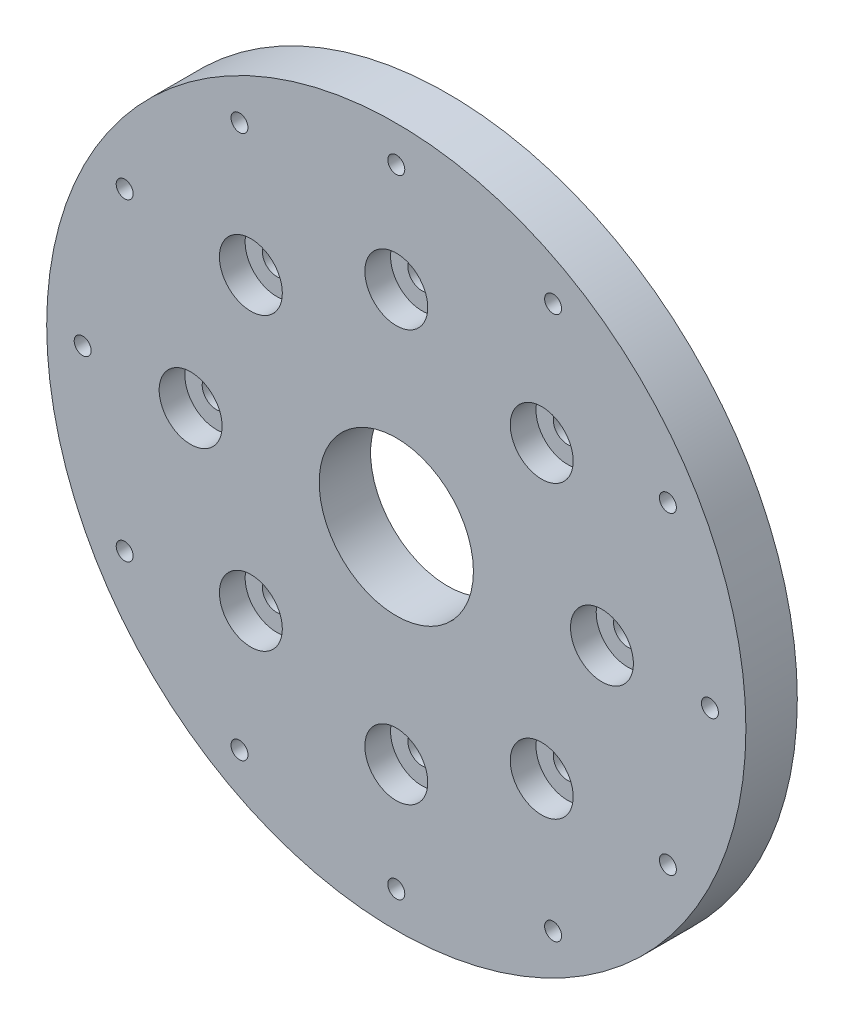
ISO-10303-21;
HEADER;
FILE_DESCRIPTION(('STEP AP214'),'2;1');
FILE_NAME('part.step','',(''),(''),'','','');
FILE_SCHEMA(('AUTOMOTIVE_DESIGN { 1 0 10303 214 1 1 1 1 }'));
ENDSEC;
DATA;
#1=APPLICATION_CONTEXT('core data for automotive mechanical design processes');
#2=APPLICATION_PROTOCOL_DEFINITION('international standard','automotive_design',2000,#1);
#3=PRODUCT_CONTEXT('',#1,'mechanical');
#4=PRODUCT('Part','Part','',(#3));
#5=PRODUCT_RELATED_PRODUCT_CATEGORY('part','',(#4));
#6=PRODUCT_DEFINITION_FORMATION('','',#4);
#7=PRODUCT_DEFINITION_CONTEXT('part definition',#1,'design');
#8=PRODUCT_DEFINITION('design','',#6,#7);
#9=PRODUCT_DEFINITION_SHAPE('','',#8);
#10=(LENGTH_UNIT() NAMED_UNIT(*) SI_UNIT(.MILLI.,.METRE.));
#11=(NAMED_UNIT(*) PLANE_ANGLE_UNIT() SI_UNIT($,.RADIAN.));
#12=(NAMED_UNIT(*) SI_UNIT($,.STERADIAN.) SOLID_ANGLE_UNIT());
#13=UNCERTAINTY_MEASURE_WITH_UNIT(LENGTH_MEASURE(1.E-05),#10,'distance_accuracy_value','');
#14=(GEOMETRIC_REPRESENTATION_CONTEXT(3) GLOBAL_UNCERTAINTY_ASSIGNED_CONTEXT((#13)) GLOBAL_UNIT_ASSIGNED_CONTEXT((#10,
#11,#12)) REPRESENTATION_CONTEXT('',''));
#15=CARTESIAN_POINT('',(0.,0.,0.));
#16=DIRECTION('',(0.,0.,1.));
#17=DIRECTION('',(1.,0.,0.));
#18=AXIS2_PLACEMENT_3D('',#15,#16,#17);
#19=CARTESIAN_POINT('',(0.,40.,10.));
#20=DIRECTION('',(0.,0.,1.));
#21=DIRECTION('',(1.,0.,0.));
#22=AXIS2_PLACEMENT_3D('',#19,#20,#21);
#23=CYLINDRICAL_SURFACE('',#22,2.75);
#24=CARTESIAN_POINT('',(0.,40.,0.));
#25=DIRECTION('',(0.,0.,1.));
#26=DIRECTION('',(1.,0.,0.));
#27=AXIS2_PLACEMENT_3D('',#24,#25,#26);
#28=CIRCLE('',#27,2.75);
#29=CARTESIAN_POINT('',(2.75,40.,0.));
#30=VERTEX_POINT('',#29);
#31=EDGE_CURVE('E126',#30,#30,#28,.T.);
#32=ORIENTED_EDGE('',*,*,#31,.F.);
#33=EDGE_LOOP('',(#32));
#34=FACE_BOUND('',#33,.T.);
#35=CARTESIAN_POINT('',(0.,40.,5.));
#36=DIRECTION('',(0.,0.,1.));
#37=DIRECTION('',(1.,0.,0.));
#38=AXIS2_PLACEMENT_3D('',#35,#36,#37);
#39=CIRCLE('',#38,2.75);
#40=CARTESIAN_POINT('',(2.75,40.,5.));
#41=VERTEX_POINT('',#40);
#42=EDGE_CURVE('E40',#41,#41,#39,.F.);
#43=ORIENTED_EDGE('',*,*,#42,.F.);
#44=EDGE_LOOP('',(#43));
#45=FACE_BOUND('',#44,.T.);
#46=ADVANCED_FACE('F36',(#34,#45),#23,.F.);
#47=CARTESIAN_POINT('',(-28.2842712474619,28.2842712474619,10.));
#48=DIRECTION('',(0.,0.,1.));
#49=DIRECTION('',(1.,0.,0.));
#50=AXIS2_PLACEMENT_3D('',#47,#48,#49);
#51=CYLINDRICAL_SURFACE('',#50,2.75);
#52=CARTESIAN_POINT('',(-28.2842712474619,28.2842712474619,0.));
#53=DIRECTION('',(0.,0.,1.));
#54=DIRECTION('',(1.,0.,0.));
#55=AXIS2_PLACEMENT_3D('',#52,#53,#54);
#56=CIRCLE('',#55,2.75);
#57=CARTESIAN_POINT('',(-25.5342712474619,28.2842712474619,0.));
#58=VERTEX_POINT('',#57);
#59=EDGE_CURVE('E120',#58,#58,#56,.T.);
#60=ORIENTED_EDGE('',*,*,#59,.F.);
#61=EDGE_LOOP('',(#60));
#62=FACE_BOUND('',#61,.T.);
#63=CARTESIAN_POINT('',(-28.2842712474619,28.2842712474619,5.));
#64=DIRECTION('',(0.,0.,1.));
#65=DIRECTION('',(1.,0.,0.));
#66=AXIS2_PLACEMENT_3D('',#63,#64,#65);
#67=CIRCLE('',#66,2.75);
#68=CARTESIAN_POINT('',(-25.5342712474619,28.2842712474619,5.));
#69=VERTEX_POINT('',#68);
#70=EDGE_CURVE('E75',#69,#69,#67,.F.);
#71=ORIENTED_EDGE('',*,*,#70,.F.);
#72=EDGE_LOOP('',(#71));
#73=FACE_BOUND('',#72,.T.);
#74=ADVANCED_FACE('F172',(#62,#73),#51,.F.);
#75=CARTESIAN_POINT('',(-40.,-1.38777878078145E-13,10.));
#76=DIRECTION('',(0.,0.,1.));
#77=DIRECTION('',(1.,0.,0.));
#78=AXIS2_PLACEMENT_3D('',#75,#76,#77);
#79=CYLINDRICAL_SURFACE('',#78,2.75);
#80=CARTESIAN_POINT('',(-40.,-1.38777878078145E-13,0.));
#81=DIRECTION('',(0.,0.,1.));
#82=DIRECTION('',(1.,0.,0.));
#83=AXIS2_PLACEMENT_3D('',#80,#81,#82);
#84=CIRCLE('',#83,2.75);
#85=CARTESIAN_POINT('',(-37.25,-1.38777878078145E-13,0.));
#86=VERTEX_POINT('',#85);
#87=EDGE_CURVE('E114',#86,#86,#84,.T.);
#88=ORIENTED_EDGE('',*,*,#87,.F.);
#89=EDGE_LOOP('',(#88));
#90=FACE_BOUND('',#89,.T.);
#91=CARTESIAN_POINT('',(-40.,-1.38777878078145E-13,5.));
#92=DIRECTION('',(0.,0.,1.));
#93=DIRECTION('',(1.,0.,0.));
#94=AXIS2_PLACEMENT_3D('',#91,#92,#93);
#95=CIRCLE('',#94,2.75);
#96=CARTESIAN_POINT('',(-37.25,-1.38777878078145E-13,5.));
#97=VERTEX_POINT('',#96);
#98=EDGE_CURVE('E73',#97,#97,#95,.F.);
#99=ORIENTED_EDGE('',*,*,#98,.F.);
#100=EDGE_LOOP('',(#99));
#101=FACE_BOUND('',#100,.T.);
#102=ADVANCED_FACE('F178',(#90,#101),#79,.F.);
#103=CARTESIAN_POINT('',(-28.284271247462,-28.2842712474618,10.));
#104=DIRECTION('',(0.,0.,1.));
#105=DIRECTION('',(1.,0.,0.));
#106=AXIS2_PLACEMENT_3D('',#103,#104,#105);
#107=CYLINDRICAL_SURFACE('',#106,2.75);
#108=CARTESIAN_POINT('',(-28.284271247462,-28.2842712474618,0.));
#109=DIRECTION('',(0.,0.,1.));
#110=DIRECTION('',(1.,0.,0.));
#111=AXIS2_PLACEMENT_3D('',#108,#109,#110);
#112=CIRCLE('',#111,2.75);
#113=CARTESIAN_POINT('',(-25.534271247462,-28.2842712474618,0.));
#114=VERTEX_POINT('',#113);
#115=EDGE_CURVE('E108',#114,#114,#112,.T.);
#116=ORIENTED_EDGE('',*,*,#115,.F.);
#117=EDGE_LOOP('',(#116));
#118=FACE_BOUND('',#117,.T.);
#119=CARTESIAN_POINT('',(-28.284271247462,-28.2842712474618,5.));
#120=DIRECTION('',(0.,0.,1.));
#121=DIRECTION('',(1.,0.,0.));
#122=AXIS2_PLACEMENT_3D('',#119,#120,#121);
#123=CIRCLE('',#122,2.75);
#124=CARTESIAN_POINT('',(-25.534271247462,-28.2842712474618,5.));
#125=VERTEX_POINT('',#124);
#126=EDGE_CURVE('E70',#125,#125,#123,.F.);
#127=ORIENTED_EDGE('',*,*,#126,.F.);
#128=EDGE_LOOP('',(#127));
#129=FACE_BOUND('',#128,.T.);
#130=ADVANCED_FACE('F243',(#118,#129),#107,.F.);
#131=CARTESIAN_POINT('',(2.77555756156289E-13,-40.,10.));
#132=DIRECTION('',(0.,0.,1.));
#133=DIRECTION('',(1.,0.,0.));
#134=AXIS2_PLACEMENT_3D('',#131,#132,#133);
#135=CYLINDRICAL_SURFACE('',#134,2.75);
#136=CARTESIAN_POINT('',(2.77555756156289E-13,-40.,0.));
#137=DIRECTION('',(0.,0.,1.));
#138=DIRECTION('',(1.,0.,0.));
#139=AXIS2_PLACEMENT_3D('',#136,#137,#138);
#140=CIRCLE('',#139,2.75);
#141=CARTESIAN_POINT('',(2.75000000000028,-40.,0.));
#142=VERTEX_POINT('',#141);
#143=EDGE_CURVE('E102',#142,#142,#140,.T.);
#144=ORIENTED_EDGE('',*,*,#143,.F.);
#145=EDGE_LOOP('',(#144));
#146=FACE_BOUND('',#145,.T.);
#147=CARTESIAN_POINT('',(2.77555756156289E-13,-40.,5.));
#148=DIRECTION('',(0.,0.,1.));
#149=DIRECTION('',(1.,0.,0.));
#150=AXIS2_PLACEMENT_3D('',#147,#148,#149);
#151=CIRCLE('',#150,2.75);
#152=CARTESIAN_POINT('',(2.75000000000028,-40.,5.));
#153=VERTEX_POINT('',#152);
#154=EDGE_CURVE('E67',#153,#153,#151,.F.);
#155=ORIENTED_EDGE('',*,*,#154,.F.);
#156=EDGE_LOOP('',(#155));
#157=FACE_BOUND('',#156,.T.);
#158=ADVANCED_FACE('F291',(#146,#157),#135,.F.);
#159=CARTESIAN_POINT('',(28.2842712474621,-28.2842712474617,10.));
#160=DIRECTION('',(0.,0.,1.));
#161=DIRECTION('',(1.,0.,0.));
#162=AXIS2_PLACEMENT_3D('',#159,#160,#161);
#163=CYLINDRICAL_SURFACE('',#162,2.75);
#164=CARTESIAN_POINT('',(28.2842712474621,-28.2842712474617,0.));
#165=DIRECTION('',(0.,0.,1.));
#166=DIRECTION('',(1.,0.,0.));
#167=AXIS2_PLACEMENT_3D('',#164,#165,#166);
#168=CIRCLE('',#167,2.75);
#169=CARTESIAN_POINT('',(31.0342712474621,-28.2842712474617,0.));
#170=VERTEX_POINT('',#169);
#171=EDGE_CURVE('E96',#170,#170,#168,.T.);
#172=ORIENTED_EDGE('',*,*,#171,.F.);
#173=EDGE_LOOP('',(#172));
#174=FACE_BOUND('',#173,.T.);
#175=CARTESIAN_POINT('',(28.2842712474621,-28.2842712474617,5.));
#176=DIRECTION('',(0.,0.,1.));
#177=DIRECTION('',(1.,0.,0.));
#178=AXIS2_PLACEMENT_3D('',#175,#176,#177);
#179=CIRCLE('',#178,2.75);
#180=CARTESIAN_POINT('',(31.0342712474621,-28.2842712474617,5.));
#181=VERTEX_POINT('',#180);
#182=EDGE_CURVE('E63',#181,#181,#179,.F.);
#183=ORIENTED_EDGE('',*,*,#182,.F.);
#184=EDGE_LOOP('',(#183));
#185=FACE_BOUND('',#184,.T.);
#186=ADVANCED_FACE('F207',(#174,#185),#163,.F.);
#187=CARTESIAN_POINT('',(40.,4.1286418728248E-13,10.));
#188=DIRECTION('',(0.,0.,1.));
#189=DIRECTION('',(1.,0.,0.));
#190=AXIS2_PLACEMENT_3D('',#187,#188,#189);
#191=CYLINDRICAL_SURFACE('',#190,2.75);
#192=CARTESIAN_POINT('',(40.,4.1286418728248E-13,0.));
#193=DIRECTION('',(0.,0.,1.));
#194=DIRECTION('',(1.,0.,0.));
#195=AXIS2_PLACEMENT_3D('',#192,#193,#194);
#196=CIRCLE('',#195,2.75);
#197=CARTESIAN_POINT('',(42.75,4.1286418728248E-13,0.));
#198=VERTEX_POINT('',#197);
#199=EDGE_CURVE('E84',#198,#198,#196,.T.);
#200=ORIENTED_EDGE('',*,*,#199,.F.);
#201=EDGE_LOOP('',(#200));
#202=FACE_BOUND('',#201,.T.);
#203=CARTESIAN_POINT('',(40.,4.1286418728248E-13,5.));
#204=DIRECTION('',(0.,0.,1.));
#205=DIRECTION('',(1.,0.,0.));
#206=AXIS2_PLACEMENT_3D('',#203,#204,#205);
#207=CIRCLE('',#206,2.75);
#208=CARTESIAN_POINT('',(42.75,4.1286418728248E-13,5.));
#209=VERTEX_POINT('',#208);
#210=EDGE_CURVE('E60',#209,#209,#207,.F.);
#211=ORIENTED_EDGE('',*,*,#210,.F.);
#212=EDGE_LOOP('',(#211));
#213=FACE_BOUND('',#212,.T.);
#214=ADVANCED_FACE('F200',(#202,#213),#191,.F.);
#215=CARTESIAN_POINT('',(28.284271247462,28.2842712474618,10.));
#216=DIRECTION('',(0.,0.,1.));
#217=DIRECTION('',(1.,0.,0.));
#218=AXIS2_PLACEMENT_3D('',#215,#216,#217);
#219=CYLINDRICAL_SURFACE('',#218,2.75);
#220=CARTESIAN_POINT('',(28.284271247462,28.2842712474618,0.));
#221=DIRECTION('',(0.,0.,1.));
#222=DIRECTION('',(1.,0.,0.));
#223=AXIS2_PLACEMENT_3D('',#220,#221,#222);
#224=CIRCLE('',#223,2.75);
#225=CARTESIAN_POINT('',(31.034271247462,28.2842712474618,0.));
#226=VERTEX_POINT('',#225);
#227=EDGE_CURVE('E139',#226,#226,#224,.T.);
#228=ORIENTED_EDGE('',*,*,#227,.F.);
#229=EDGE_LOOP('',(#228));
#230=FACE_BOUND('',#229,.T.);
#231=CARTESIAN_POINT('',(28.284271247462,28.2842712474618,5.));
#232=DIRECTION('',(0.,0.,1.));
#233=DIRECTION('',(1.,0.,0.));
#234=AXIS2_PLACEMENT_3D('',#231,#232,#233);
#235=CIRCLE('',#234,2.75);
#236=CARTESIAN_POINT('',(31.034271247462,28.2842712474618,5.));
#237=VERTEX_POINT('',#236);
#238=EDGE_CURVE('E55',#237,#237,#235,.F.);
#239=ORIENTED_EDGE('',*,*,#238,.F.);
#240=EDGE_LOOP('',(#239));
#241=FACE_BOUND('',#240,.T.);
#242=ADVANCED_FACE('F197',(#230,#241),#219,.F.);
#243=CARTESIAN_POINT('',(0.,0.,10.));
#244=DIRECTION('',(0.,0.,1.));
#245=DIRECTION('',(1.,0.,0.));
#246=AXIS2_PLACEMENT_3D('',#243,#244,#245);
#247=PLANE('',#246);
#248=CARTESIAN_POINT('',(30.4999999999993,52.8275496308511,10.));
#249=DIRECTION('',(0.,0.,1.));
#250=DIRECTION('',(1.,0.,0.));
#251=AXIS2_PLACEMENT_3D('',#248,#249,#250);
#252=CIRCLE('',#251,1.65);
#253=CARTESIAN_POINT('',(32.1499999999993,52.8275496308511,10.));
#254=VERTEX_POINT('',#253);
#255=EDGE_CURVE('E412',#254,#254,#252,.T.);
#256=ORIENTED_EDGE('',*,*,#255,.F.);
#257=EDGE_LOOP('',(#256));
#258=FACE_BOUND('',#257,.T.);
#259=CARTESIAN_POINT('',(52.8275496308503,30.5000000000006,10.));
#260=DIRECTION('',(0.,0.,1.));
#261=DIRECTION('',(1.,0.,0.));
#262=AXIS2_PLACEMENT_3D('',#259,#260,#261);
#263=CIRCLE('',#262,1.65);
#264=CARTESIAN_POINT('',(54.4775496308503,30.5000000000006,10.));
#265=VERTEX_POINT('',#264);
#266=EDGE_CURVE('E406',#265,#265,#263,.T.);
#267=ORIENTED_EDGE('',*,*,#266,.F.);
#268=EDGE_LOOP('',(#267));
#269=FACE_BOUND('',#268,.T.);
#270=CARTESIAN_POINT('',(60.9999999999999,6.38941085008293E-13,10.));
#271=DIRECTION('',(0.,0.,1.));
#272=DIRECTION('',(1.,0.,0.));
#273=AXIS2_PLACEMENT_3D('',#270,#271,#272);
#274=CIRCLE('',#273,1.65);
#275=CARTESIAN_POINT('',(62.6499999999999,6.38941085008293E-13,10.));
#276=VERTEX_POINT('',#275);
#277=EDGE_CURVE('E400',#276,#276,#274,.T.);
#278=ORIENTED_EDGE('',*,*,#277,.F.);
#279=EDGE_LOOP('',(#278));
#280=FACE_BOUND('',#279,.T.);
#281=CARTESIAN_POINT('',(52.827549630851,-30.4999999999995,10.));
#282=DIRECTION('',(0.,0.,1.));
#283=DIRECTION('',(1.,0.,0.));
#284=AXIS2_PLACEMENT_3D('',#281,#282,#283);
#285=CIRCLE('',#284,1.65);
#286=CARTESIAN_POINT('',(54.477549630851,-30.4999999999995,10.));
#287=VERTEX_POINT('',#286);
#288=EDGE_CURVE('E394',#287,#287,#285,.T.);
#289=ORIENTED_EDGE('',*,*,#288,.F.);
#290=EDGE_LOOP('',(#289));
#291=FACE_BOUND('',#290,.T.);
#292=CARTESIAN_POINT('',(30.5000000000004,-52.8275496308505,10.));
#293=DIRECTION('',(0.,0.,1.));
#294=DIRECTION('',(1.,0.,0.));
#295=AXIS2_PLACEMENT_3D('',#292,#293,#294);
#296=CIRCLE('',#295,1.65);
#297=CARTESIAN_POINT('',(32.1500000000004,-52.8275496308505,10.));
#298=VERTEX_POINT('',#297);
#299=EDGE_CURVE('E388',#298,#298,#296,.T.);
#300=ORIENTED_EDGE('',*,*,#299,.F.);
#301=EDGE_LOOP('',(#300));
#302=FACE_BOUND('',#301,.T.);
#303=CARTESIAN_POINT('',(0.,-60.9999999999999,10.));
#304=DIRECTION('',(0.,0.,1.));
#305=DIRECTION('',(1.,0.,0.));
#306=AXIS2_PLACEMENT_3D('',#303,#304,#305);
#307=CIRCLE('',#306,1.65);
#308=CARTESIAN_POINT('',(1.65,-60.9999999999999,10.));
#309=VERTEX_POINT('',#308);
#310=EDGE_CURVE('E382',#309,#309,#307,.T.);
#311=ORIENTED_EDGE('',*,*,#310,.F.);
#312=EDGE_LOOP('',(#311));
#313=FACE_BOUND('',#312,.T.);
#314=CARTESIAN_POINT('',(-30.4999999999997,-52.8275496308509,10.));
#315=DIRECTION('',(0.,0.,1.));
#316=DIRECTION('',(1.,0.,0.));
#317=AXIS2_PLACEMENT_3D('',#314,#315,#316);
#318=CIRCLE('',#317,1.65);
#319=CARTESIAN_POINT('',(-28.8499999999997,-52.8275496308509,10.));
#320=VERTEX_POINT('',#319);
#321=EDGE_CURVE('E376',#320,#320,#318,.T.);
#322=ORIENTED_EDGE('',*,*,#321,.F.);
#323=EDGE_LOOP('',(#322));
#324=FACE_BOUND('',#323,.T.);
#325=CARTESIAN_POINT('',(-52.8275496308506,-30.5000000000002,10.));
#326=DIRECTION('',(0.,0.,1.));
#327=DIRECTION('',(1.,0.,0.));
#328=AXIS2_PLACEMENT_3D('',#325,#326,#327);
#329=CIRCLE('',#328,1.65);
#330=CARTESIAN_POINT('',(-51.1775496308506,-30.5000000000002,10.));
#331=VERTEX_POINT('',#330);
#332=EDGE_CURVE('E370',#331,#331,#329,.T.);
#333=ORIENTED_EDGE('',*,*,#332,.F.);
#334=EDGE_LOOP('',(#333));
#335=FACE_BOUND('',#334,.T.);
#336=CARTESIAN_POINT('',(-60.9999999999999,-2.12980361669431E-13,10.));
#337=DIRECTION('',(0.,0.,1.));
#338=DIRECTION('',(1.,0.,0.));
#339=AXIS2_PLACEMENT_3D('',#336,#337,#338);
#340=CIRCLE('',#339,1.65);
#341=CARTESIAN_POINT('',(-59.3499999999999,-2.12980361669431E-13,10.));
#342=VERTEX_POINT('',#341);
#343=EDGE_CURVE('E364',#342,#342,#340,.T.);
#344=ORIENTED_EDGE('',*,*,#343,.F.);
#345=EDGE_LOOP('',(#344));
#346=FACE_BOUND('',#345,.T.);
#347=CARTESIAN_POINT('',(-52.8275496308508,30.4999999999999,10.));
#348=DIRECTION('',(0.,0.,1.));
#349=DIRECTION('',(1.,0.,0.));
#350=AXIS2_PLACEMENT_3D('',#347,#348,#349);
#351=CIRCLE('',#350,1.65);
#352=CARTESIAN_POINT('',(-51.1775496308508,30.4999999999999,10.));
#353=VERTEX_POINT('',#352);
#354=EDGE_CURVE('E358',#353,#353,#351,.T.);
#355=ORIENTED_EDGE('',*,*,#354,.F.);
#356=EDGE_LOOP('',(#355));
#357=FACE_BOUND('',#356,.T.);
#358=CARTESIAN_POINT('',(-30.5,52.8275496308507,10.));
#359=DIRECTION('',(0.,0.,1.));
#360=DIRECTION('',(1.,0.,0.));
#361=AXIS2_PLACEMENT_3D('',#358,#359,#360);
#362=CIRCLE('',#361,1.65);
#363=CARTESIAN_POINT('',(-28.85,52.8275496308507,10.));
#364=VERTEX_POINT('',#363);
#365=EDGE_CURVE('E350',#364,#364,#362,.T.);
#366=ORIENTED_EDGE('',*,*,#365,.F.);
#367=EDGE_LOOP('',(#366));
#368=FACE_BOUND('',#367,.T.);
#369=CARTESIAN_POINT('',(0.,60.9999999999999,10.));
#370=DIRECTION('',(0.,0.,1.));
#371=DIRECTION('',(1.,0.,0.));
#372=AXIS2_PLACEMENT_3D('',#369,#370,#371);
#373=CIRCLE('',#372,1.65);
#374=CARTESIAN_POINT('',(1.65,60.9999999999999,10.));
#375=VERTEX_POINT('',#374);
#376=EDGE_CURVE('E342',#375,#375,#373,.T.);
#377=ORIENTED_EDGE('',*,*,#376,.F.);
#378=EDGE_LOOP('',(#377));
#379=FACE_BOUND('',#378,.T.);
#380=CARTESIAN_POINT('',(40.,4.1286418728248E-13,10.));
#381=DIRECTION('',(0.,0.,1.));
#382=DIRECTION('',(1.,0.,0.));
#383=AXIS2_PLACEMENT_3D('',#380,#381,#382);
#384=CIRCLE('',#383,6.11899999999999);
#385=CARTESIAN_POINT('',(46.119,4.1286418728248E-13,10.));
#386=VERTEX_POINT('',#385);
#387=EDGE_CURVE('E80',#386,#386,#384,.T.);
#388=ORIENTED_EDGE('',*,*,#387,.F.);
#389=EDGE_LOOP('',(#388));
#390=FACE_BOUND('',#389,.T.);
#391=CARTESIAN_POINT('',(28.2842712474621,-28.2842712474617,10.));
#392=DIRECTION('',(0.,0.,1.));
#393=DIRECTION('',(1.,0.,0.));
#394=AXIS2_PLACEMENT_3D('',#391,#392,#393);
#395=CIRCLE('',#394,6.119);
#396=CARTESIAN_POINT('',(34.4032712474621,-28.2842712474617,10.));
#397=VERTEX_POINT('',#396);
#398=EDGE_CURVE('E89',#397,#397,#395,.T.);
#399=ORIENTED_EDGE('',*,*,#398,.F.);
#400=EDGE_LOOP('',(#399));
#401=FACE_BOUND('',#400,.T.);
#402=CARTESIAN_POINT('',(2.77555756156289E-13,-40.,10.));
#403=DIRECTION('',(0.,0.,1.));
#404=DIRECTION('',(1.,0.,0.));
#405=AXIS2_PLACEMENT_3D('',#402,#403,#404);
#406=CIRCLE('',#405,6.119);
#407=CARTESIAN_POINT('',(6.11900000000027,-40.,10.));
#408=VERTEX_POINT('',#407);
#409=EDGE_CURVE('E99',#408,#408,#406,.T.);
#410=ORIENTED_EDGE('',*,*,#409,.F.);
#411=EDGE_LOOP('',(#410));
#412=FACE_BOUND('',#411,.T.);
#413=CARTESIAN_POINT('',(-28.284271247462,-28.2842712474618,10.));
#414=DIRECTION('',(0.,0.,1.));
#415=DIRECTION('',(1.,0.,0.));
#416=AXIS2_PLACEMENT_3D('',#413,#414,#415);
#417=CIRCLE('',#416,6.119);
#418=CARTESIAN_POINT('',(-22.165271247462,-28.2842712474618,10.));
#419=VERTEX_POINT('',#418);
#420=EDGE_CURVE('E105',#419,#419,#417,.T.);
#421=ORIENTED_EDGE('',*,*,#420,.F.);
#422=EDGE_LOOP('',(#421));
#423=FACE_BOUND('',#422,.T.);
#424=CARTESIAN_POINT('',(-40.,-1.38777878078145E-13,10.));
#425=DIRECTION('',(0.,0.,1.));
#426=DIRECTION('',(1.,0.,0.));
#427=AXIS2_PLACEMENT_3D('',#424,#425,#426);
#428=CIRCLE('',#427,6.11899999999999);
#429=CARTESIAN_POINT('',(-33.881,-1.38777878078145E-13,10.));
#430=VERTEX_POINT('',#429);
#431=EDGE_CURVE('E111',#430,#430,#428,.T.);
#432=ORIENTED_EDGE('',*,*,#431,.F.);
#433=EDGE_LOOP('',(#432));
#434=FACE_BOUND('',#433,.T.);
#435=CARTESIAN_POINT('',(-28.2842712474619,28.2842712474619,10.));
#436=DIRECTION('',(0.,0.,1.));
#437=DIRECTION('',(1.,0.,0.));
#438=AXIS2_PLACEMENT_3D('',#435,#436,#437);
#439=CIRCLE('',#438,6.119);
#440=CARTESIAN_POINT('',(-22.165271247462,28.2842712474619,10.));
#441=VERTEX_POINT('',#440);
#442=EDGE_CURVE('E117',#441,#441,#439,.T.);
#443=ORIENTED_EDGE('',*,*,#442,.F.);
#444=EDGE_LOOP('',(#443));
#445=FACE_BOUND('',#444,.T.);
#446=CARTESIAN_POINT('',(0.,40.,10.));
#447=DIRECTION('',(0.,0.,1.));
#448=DIRECTION('',(1.,0.,0.));
#449=AXIS2_PLACEMENT_3D('',#446,#447,#448);
#450=CIRCLE('',#449,6.119);
#451=CARTESIAN_POINT('',(6.119,40.,10.));
#452=VERTEX_POINT('',#451);
#453=EDGE_CURVE('E123',#452,#452,#450,.T.);
#454=ORIENTED_EDGE('',*,*,#453,.F.);
#455=EDGE_LOOP('',(#454));
#456=FACE_BOUND('',#455,.T.);
#457=CARTESIAN_POINT('',(0.,0.,10.));
#458=DIRECTION('',(0.,0.,1.));
#459=DIRECTION('',(1.,0.,0.));
#460=AXIS2_PLACEMENT_3D('',#457,#458,#459);
#461=CIRCLE('',#460,15.);
#462=CARTESIAN_POINT('',(15.,0.,10.));
#463=VERTEX_POINT('',#462);
#464=EDGE_CURVE('E44',#463,#463,#461,.T.);
#465=ORIENTED_EDGE('',*,*,#464,.F.);
#466=EDGE_LOOP('',(#465));
#467=FACE_BOUND('',#466,.T.);
#468=CARTESIAN_POINT('',(28.284271247462,28.2842712474618,10.));
#469=DIRECTION('',(0.,0.,1.));
#470=DIRECTION('',(1.,0.,0.));
#471=AXIS2_PLACEMENT_3D('',#468,#469,#470);
#472=CIRCLE('',#471,6.119);
#473=CARTESIAN_POINT('',(34.403271247462,28.2842712474618,10.));
#474=VERTEX_POINT('',#473);
#475=EDGE_CURVE('E134',#474,#474,#472,.T.);
#476=ORIENTED_EDGE('',*,*,#475,.F.);
#477=EDGE_LOOP('',(#476));
#478=FACE_BOUND('',#477,.T.);
#479=CARTESIAN_POINT('',(0.,0.,10.));
#480=DIRECTION('',(0.,0.,1.));
#481=DIRECTION('',(1.,0.,0.));
#482=AXIS2_PLACEMENT_3D('',#479,#480,#481);
#483=CIRCLE('',#482,68.);
#484=CARTESIAN_POINT('',(68.,0.,10.));
#485=VERTEX_POINT('',#484);
#486=EDGE_CURVE('E58',#485,#485,#483,.T.);
#487=ORIENTED_EDGE('',*,*,#486,.T.);
#488=EDGE_LOOP('',(#487));
#489=FACE_BOUND('',#488,.T.);
#490=ADVANCED_FACE('F199',(#258,#269,#280,#291,#302,#313,#324,#335,#346,#357,#368,#379,#390,
#401,#412,#423,#434,#445,#456,#467,#478,#489),#247,.T.);
#491=CARTESIAN_POINT('',(0.,0.,0.));
#492=DIRECTION('',(0.,0.,1.));
#493=DIRECTION('',(1.,0.,0.));
#494=AXIS2_PLACEMENT_3D('',#491,#492,#493);
#495=PLANE('',#494);
#496=CARTESIAN_POINT('',(30.4999999999993,52.8275496308511,0.));
#497=DIRECTION('',(0.,0.,1.));
#498=DIRECTION('',(1.,0.,0.));
#499=AXIS2_PLACEMENT_3D('',#496,#497,#498);
#500=CIRCLE('',#499,1.65);
#501=CARTESIAN_POINT('',(32.1499999999993,52.8275496308511,0.));
#502=VERTEX_POINT('',#501);
#503=EDGE_CURVE('E409',#502,#502,#500,.T.);
#504=ORIENTED_EDGE('',*,*,#503,.T.);
#505=EDGE_LOOP('',(#504));
#506=FACE_BOUND('',#505,.T.);
#507=CARTESIAN_POINT('',(52.8275496308503,30.5000000000006,0.));
#508=DIRECTION('',(0.,0.,1.));
#509=DIRECTION('',(1.,0.,0.));
#510=AXIS2_PLACEMENT_3D('',#507,#508,#509);
#511=CIRCLE('',#510,1.65);
#512=CARTESIAN_POINT('',(54.4775496308503,30.5000000000006,0.));
#513=VERTEX_POINT('',#512);
#514=EDGE_CURVE('E403',#513,#513,#511,.T.);
#515=ORIENTED_EDGE('',*,*,#514,.T.);
#516=EDGE_LOOP('',(#515));
#517=FACE_BOUND('',#516,.T.);
#518=CARTESIAN_POINT('',(60.9999999999999,6.38941085008293E-13,0.));
#519=DIRECTION('',(0.,0.,1.));
#520=DIRECTION('',(1.,0.,0.));
#521=AXIS2_PLACEMENT_3D('',#518,#519,#520);
#522=CIRCLE('',#521,1.65);
#523=CARTESIAN_POINT('',(62.6499999999999,6.38941085008293E-13,0.));
#524=VERTEX_POINT('',#523);
#525=EDGE_CURVE('E397',#524,#524,#522,.T.);
#526=ORIENTED_EDGE('',*,*,#525,.T.);
#527=EDGE_LOOP('',(#526));
#528=FACE_BOUND('',#527,.T.);
#529=CARTESIAN_POINT('',(52.827549630851,-30.4999999999995,0.));
#530=DIRECTION('',(0.,0.,1.));
#531=DIRECTION('',(1.,0.,0.));
#532=AXIS2_PLACEMENT_3D('',#529,#530,#531);
#533=CIRCLE('',#532,1.65);
#534=CARTESIAN_POINT('',(54.477549630851,-30.4999999999995,0.));
#535=VERTEX_POINT('',#534);
#536=EDGE_CURVE('E391',#535,#535,#533,.T.);
#537=ORIENTED_EDGE('',*,*,#536,.T.);
#538=EDGE_LOOP('',(#537));
#539=FACE_BOUND('',#538,.T.);
#540=CARTESIAN_POINT('',(30.5000000000004,-52.8275496308505,0.));
#541=DIRECTION('',(0.,0.,1.));
#542=DIRECTION('',(1.,0.,0.));
#543=AXIS2_PLACEMENT_3D('',#540,#541,#542);
#544=CIRCLE('',#543,1.65);
#545=CARTESIAN_POINT('',(32.1500000000004,-52.8275496308505,0.));
#546=VERTEX_POINT('',#545);
#547=EDGE_CURVE('E385',#546,#546,#544,.T.);
#548=ORIENTED_EDGE('',*,*,#547,.T.);
#549=EDGE_LOOP('',(#548));
#550=FACE_BOUND('',#549,.T.);
#551=CARTESIAN_POINT('',(0.,-60.9999999999999,0.));
#552=DIRECTION('',(0.,0.,1.));
#553=DIRECTION('',(1.,0.,0.));
#554=AXIS2_PLACEMENT_3D('',#551,#552,#553);
#555=CIRCLE('',#554,1.65);
#556=CARTESIAN_POINT('',(1.65,-60.9999999999999,0.));
#557=VERTEX_POINT('',#556);
#558=EDGE_CURVE('E379',#557,#557,#555,.T.);
#559=ORIENTED_EDGE('',*,*,#558,.T.);
#560=EDGE_LOOP('',(#559));
#561=FACE_BOUND('',#560,.T.);
#562=CARTESIAN_POINT('',(-30.4999999999997,-52.8275496308509,0.));
#563=DIRECTION('',(0.,0.,1.));
#564=DIRECTION('',(1.,0.,0.));
#565=AXIS2_PLACEMENT_3D('',#562,#563,#564);
#566=CIRCLE('',#565,1.65);
#567=CARTESIAN_POINT('',(-28.8499999999997,-52.8275496308509,0.));
#568=VERTEX_POINT('',#567);
#569=EDGE_CURVE('E373',#568,#568,#566,.T.);
#570=ORIENTED_EDGE('',*,*,#569,.T.);
#571=EDGE_LOOP('',(#570));
#572=FACE_BOUND('',#571,.T.);
#573=CARTESIAN_POINT('',(-52.8275496308506,-30.5000000000002,0.));
#574=DIRECTION('',(0.,0.,1.));
#575=DIRECTION('',(1.,0.,0.));
#576=AXIS2_PLACEMENT_3D('',#573,#574,#575);
#577=CIRCLE('',#576,1.65);
#578=CARTESIAN_POINT('',(-51.1775496308506,-30.5000000000002,0.));
#579=VERTEX_POINT('',#578);
#580=EDGE_CURVE('E367',#579,#579,#577,.T.);
#581=ORIENTED_EDGE('',*,*,#580,.T.);
#582=EDGE_LOOP('',(#581));
#583=FACE_BOUND('',#582,.T.);
#584=CARTESIAN_POINT('',(-60.9999999999999,-2.12980361669431E-13,0.));
#585=DIRECTION('',(0.,0.,1.));
#586=DIRECTION('',(1.,0.,0.));
#587=AXIS2_PLACEMENT_3D('',#584,#585,#586);
#588=CIRCLE('',#587,1.65);
#589=CARTESIAN_POINT('',(-59.3499999999999,-2.12980361669431E-13,0.));
#590=VERTEX_POINT('',#589);
#591=EDGE_CURVE('E361',#590,#590,#588,.T.);
#592=ORIENTED_EDGE('',*,*,#591,.T.);
#593=EDGE_LOOP('',(#592));
#594=FACE_BOUND('',#593,.T.);
#595=CARTESIAN_POINT('',(-52.8275496308508,30.4999999999999,0.));
#596=DIRECTION('',(0.,0.,1.));
#597=DIRECTION('',(1.,0.,0.));
#598=AXIS2_PLACEMENT_3D('',#595,#596,#597);
#599=CIRCLE('',#598,1.65);
#600=CARTESIAN_POINT('',(-51.1775496308508,30.4999999999999,0.));
#601=VERTEX_POINT('',#600);
#602=EDGE_CURVE('E355',#601,#601,#599,.T.);
#603=ORIENTED_EDGE('',*,*,#602,.T.);
#604=EDGE_LOOP('',(#603));
#605=FACE_BOUND('',#604,.T.);
#606=CARTESIAN_POINT('',(-30.5,52.8275496308507,0.));
#607=DIRECTION('',(0.,0.,1.));
#608=DIRECTION('',(1.,0.,0.));
#609=AXIS2_PLACEMENT_3D('',#606,#607,#608);
#610=CIRCLE('',#609,1.65);
#611=CARTESIAN_POINT('',(-28.85,52.8275496308507,0.));
#612=VERTEX_POINT('',#611);
#613=EDGE_CURVE('E346',#612,#612,#610,.T.);
#614=ORIENTED_EDGE('',*,*,#613,.T.);
#615=EDGE_LOOP('',(#614));
#616=FACE_BOUND('',#615,.T.);
#617=CARTESIAN_POINT('',(0.,60.9999999999999,0.));
#618=DIRECTION('',(0.,0.,1.));
#619=DIRECTION('',(1.,0.,0.));
#620=AXIS2_PLACEMENT_3D('',#617,#618,#619);
#621=CIRCLE('',#620,1.65);
#622=CARTESIAN_POINT('',(1.65,60.9999999999999,0.));
#623=VERTEX_POINT('',#622);
#624=EDGE_CURVE('E328',#623,#623,#621,.T.);
#625=ORIENTED_EDGE('',*,*,#624,.T.);
#626=EDGE_LOOP('',(#625));
#627=FACE_BOUND('',#626,.T.);
#628=CARTESIAN_POINT('',(0.,0.,0.));
#629=DIRECTION('',(0.,0.,1.));
#630=DIRECTION('',(1.,0.,0.));
#631=AXIS2_PLACEMENT_3D('',#628,#629,#630);
#632=CIRCLE('',#631,55.);
#633=CARTESIAN_POINT('',(55.,0.,0.));
#634=VERTEX_POINT('',#633);
#635=EDGE_CURVE('E52',#634,#634,#632,.T.);
#636=ORIENTED_EDGE('',*,*,#635,.T.);
#637=EDGE_LOOP('',(#636));
#638=FACE_BOUND('',#637,.T.);
#639=CARTESIAN_POINT('',(0.,0.,0.));
#640=DIRECTION('',(0.,0.,1.));
#641=DIRECTION('',(1.,0.,0.));
#642=AXIS2_PLACEMENT_3D('',#639,#640,#641);
#643=CIRCLE('',#642,68.);
#644=CARTESIAN_POINT('',(68.,0.,0.));
#645=VERTEX_POINT('',#644);
#646=EDGE_CURVE('E131',#645,#645,#643,.T.);
#647=ORIENTED_EDGE('',*,*,#646,.F.);
#648=EDGE_LOOP('',(#647));
#649=FACE_BOUND('',#648,.T.);
#650=ADVANCED_FACE('F38',(#506,#517,#528,#539,#550,#561,#572,#583,#594,#605,#616,#627,#638,
#649),#495,.F.);
#651=ORIENTED_EDGE('',*,*,#199,.T.);
#652=EDGE_LOOP('',(#651));
#653=FACE_BOUND('',#652,.T.);
#654=ORIENTED_EDGE('',*,*,#171,.T.);
#655=EDGE_LOOP('',(#654));
#656=FACE_BOUND('',#655,.T.);
#657=ORIENTED_EDGE('',*,*,#143,.T.);
#658=EDGE_LOOP('',(#657));
#659=FACE_BOUND('',#658,.T.);
#660=ORIENTED_EDGE('',*,*,#115,.T.);
#661=EDGE_LOOP('',(#660));
#662=FACE_BOUND('',#661,.T.);
#663=ORIENTED_EDGE('',*,*,#87,.T.);
#664=EDGE_LOOP('',(#663));
#665=FACE_BOUND('',#664,.T.);
#666=ORIENTED_EDGE('',*,*,#59,.T.);
#667=EDGE_LOOP('',(#666));
#668=FACE_BOUND('',#667,.T.);
#669=ORIENTED_EDGE('',*,*,#31,.T.);
#670=EDGE_LOOP('',(#669));
#671=FACE_BOUND('',#670,.T.);
#672=ORIENTED_EDGE('',*,*,#227,.T.);
#673=EDGE_LOOP('',(#672));
#674=FACE_BOUND('',#673,.T.);
#675=CARTESIAN_POINT('',(0.,0.,0.));
#676=DIRECTION('',(0.,0.,1.));
#677=DIRECTION('',(1.,0.,0.));
#678=AXIS2_PLACEMENT_3D('',#675,#676,#677);
#679=CIRCLE('',#678,15.);
#680=CARTESIAN_POINT('',(15.,0.,0.));
#681=VERTEX_POINT('',#680);
#682=EDGE_CURVE('E10',#681,#681,#679,.T.);
#683=ORIENTED_EDGE('',*,*,#682,.T.);
#684=EDGE_LOOP('',(#683));
#685=FACE_BOUND('',#684,.T.);
#686=CARTESIAN_POINT('',(0.,0.,0.));
#687=DIRECTION('',(0.,0.,1.));
#688=DIRECTION('',(1.,0.,0.));
#689=AXIS2_PLACEMENT_3D('',#686,#687,#688);
#690=CIRCLE('',#689,53.);
#691=CARTESIAN_POINT('',(53.,0.,0.));
#692=VERTEX_POINT('',#691);
#693=EDGE_CURVE('E142',#692,#692,#690,.T.);
#694=ORIENTED_EDGE('',*,*,#693,.F.);
#695=EDGE_LOOP('',(#694));
#696=FACE_BOUND('',#695,.T.);
#697=ADVANCED_FACE('F215',(#653,#656,#659,#662,#665,#668,#671,#674,#685,#696),#495,.F.);
#698=CARTESIAN_POINT('',(0.,0.,0.));
#699=DIRECTION('',(0.,0.,1.));
#700=DIRECTION('',(1.,0.,0.));
#701=AXIS2_PLACEMENT_3D('',#698,#699,#700);
#702=CYLINDRICAL_SURFACE('',#701,15.);
#703=ORIENTED_EDGE('',*,*,#682,.F.);
#704=EDGE_LOOP('',(#703));
#705=FACE_BOUND('',#704,.T.);
#706=ORIENTED_EDGE('',*,*,#464,.T.);
#707=EDGE_LOOP('',(#706));
#708=FACE_BOUND('',#707,.T.);
#709=ADVANCED_FACE('F167',(#705,#708),#702,.F.);
#710=CARTESIAN_POINT('',(0.,0.,1.3208));
#711=DIRECTION('',(0.,0.,1.));
#712=DIRECTION('',(1.,0.,0.));
#713=AXIS2_PLACEMENT_3D('',#710,#711,#712);
#714=PLANE('',#713);
#715=CARTESIAN_POINT('',(0.,0.,1.3208));
#716=DIRECTION('',(0.,0.,1.));
#717=DIRECTION('',(1.,0.,0.));
#718=AXIS2_PLACEMENT_3D('',#715,#716,#717);
#719=CIRCLE('',#718,55.);
#720=CARTESIAN_POINT('',(55.,0.,1.3208));
#721=VERTEX_POINT('',#720);
#722=EDGE_CURVE('E49',#721,#721,#719,.T.);
#723=ORIENTED_EDGE('',*,*,#722,.F.);
#724=EDGE_LOOP('',(#723));
#725=FACE_BOUND('',#724,.T.);
#726=CARTESIAN_POINT('',(0.,0.,1.3208));
#727=DIRECTION('',(0.,0.,1.));
#728=DIRECTION('',(1.,0.,0.));
#729=AXIS2_PLACEMENT_3D('',#726,#727,#728);
#730=CIRCLE('',#729,53.);
#731=CARTESIAN_POINT('',(53.,0.,1.3208));
#732=VERTEX_POINT('',#731);
#733=EDGE_CURVE('E143',#732,#732,#730,.T.);
#734=ORIENTED_EDGE('',*,*,#733,.T.);
#735=EDGE_LOOP('',(#734));
#736=FACE_BOUND('',#735,.T.);
#737=ADVANCED_FACE('F158',(#725,#736),#714,.F.);
#738=CARTESIAN_POINT('',(0.,0.,1.3208));
#739=DIRECTION('',(0.,0.,-1.));
#740=DIRECTION('',(-1.,0.,0.));
#741=AXIS2_PLACEMENT_3D('',#738,#739,#740);
#742=CYLINDRICAL_SURFACE('',#741,55.);
#743=ORIENTED_EDGE('',*,*,#722,.T.);
#744=EDGE_LOOP('',(#743));
#745=FACE_BOUND('',#744,.T.);
#746=ORIENTED_EDGE('',*,*,#635,.F.);
#747=EDGE_LOOP('',(#746));
#748=FACE_BOUND('',#747,.T.);
#749=ADVANCED_FACE('F155',(#745,#748),#742,.F.);
#750=CARTESIAN_POINT('',(0.,0.,1.3208));
#751=DIRECTION('',(0.,0.,-1.));
#752=DIRECTION('',(-1.,0.,0.));
#753=AXIS2_PLACEMENT_3D('',#750,#751,#752);
#754=CYLINDRICAL_SURFACE('',#753,53.);
#755=ORIENTED_EDGE('',*,*,#733,.F.);
#756=EDGE_LOOP('',(#755));
#757=FACE_BOUND('',#756,.T.);
#758=ORIENTED_EDGE('',*,*,#693,.T.);
#759=EDGE_LOOP('',(#758));
#760=FACE_BOUND('',#759,.T.);
#761=ADVANCED_FACE('F157',(#757,#760),#754,.T.);
#762=CARTESIAN_POINT('',(28.284271247462,28.2842712474618,10.));
#763=DIRECTION('',(0.,0.,1.));
#764=DIRECTION('',(1.,0.,0.));
#765=AXIS2_PLACEMENT_3D('',#762,#763,#764);
#766=CYLINDRICAL_SURFACE('',#765,6.119);
#767=ORIENTED_EDGE('',*,*,#475,.T.);
#768=EDGE_LOOP('',(#767));
#769=FACE_BOUND('',#768,.T.);
#770=CARTESIAN_POINT('',(28.284271247462,28.2842712474618,5.));
#771=DIRECTION('',(0.,0.,1.));
#772=DIRECTION('',(1.,0.,0.));
#773=AXIS2_PLACEMENT_3D('',#770,#771,#772);
#774=CIRCLE('',#773,6.119);
#775=CARTESIAN_POINT('',(34.403271247462,28.2842712474618,5.));
#776=VERTEX_POINT('',#775);
#777=EDGE_CURVE('E59',#776,#776,#774,.T.);
#778=ORIENTED_EDGE('',*,*,#777,.F.);
#779=EDGE_LOOP('',(#778));
#780=FACE_BOUND('',#779,.T.);
#781=ADVANCED_FACE('F164',(#769,#780),#766,.F.);
#782=CARTESIAN_POINT('',(0.,0.,0.));
#783=DIRECTION('',(0.,0.,1.));
#784=DIRECTION('',(1.,0.,0.));
#785=AXIS2_PLACEMENT_3D('',#782,#783,#784);
#786=CYLINDRICAL_SURFACE('',#785,68.);
#787=ORIENTED_EDGE('',*,*,#646,.T.);
#788=EDGE_LOOP('',(#787));
#789=FACE_BOUND('',#788,.T.);
#790=ORIENTED_EDGE('',*,*,#486,.F.);
#791=EDGE_LOOP('',(#790));
#792=FACE_BOUND('',#791,.T.);
#793=ADVANCED_FACE('F189',(#789,#792),#786,.T.);
#794=CARTESIAN_POINT('',(28.284271247462,28.2842712474618,5.));
#795=DIRECTION('',(0.,0.,1.));
#796=DIRECTION('',(1.,0.,0.));
#797=AXIS2_PLACEMENT_3D('',#794,#795,#796);
#798=PLANE('',#797);
#799=ORIENTED_EDGE('',*,*,#777,.T.);
#800=EDGE_LOOP('',(#799));
#801=FACE_BOUND('',#800,.T.);
#802=ORIENTED_EDGE('',*,*,#238,.T.);
#803=EDGE_LOOP('',(#802));
#804=FACE_BOUND('',#803,.T.);
#805=ADVANCED_FACE('F186',(#801,#804),#798,.T.);
#806=CARTESIAN_POINT('',(0.,40.,10.));
#807=DIRECTION('',(0.,0.,1.));
#808=DIRECTION('',(1.,0.,0.));
#809=AXIS2_PLACEMENT_3D('',#806,#807,#808);
#810=CYLINDRICAL_SURFACE('',#809,6.119);
#811=ORIENTED_EDGE('',*,*,#453,.T.);
#812=EDGE_LOOP('',(#811));
#813=FACE_BOUND('',#812,.T.);
#814=CARTESIAN_POINT('',(0.,40.,5.));
#815=DIRECTION('',(0.,0.,1.));
#816=DIRECTION('',(0.707106781186546,0.707106781186549,0.));
#817=AXIS2_PLACEMENT_3D('',#814,#815,#816);
#818=CIRCLE('',#817,6.119);
#819=CARTESIAN_POINT('',(4.32678639408048,44.3267863940805,5.));
#820=VERTEX_POINT('',#819);
#821=EDGE_CURVE('E64',#820,#820,#818,.T.);
#822=ORIENTED_EDGE('',*,*,#821,.F.);
#823=EDGE_LOOP('',(#822));
#824=FACE_BOUND('',#823,.T.);
#825=ADVANCED_FACE('F185',(#813,#824),#810,.F.);
#826=CARTESIAN_POINT('',(-28.2842712474619,28.2842712474619,10.));
#827=DIRECTION('',(0.,0.,1.));
#828=DIRECTION('',(1.,0.,0.));
#829=AXIS2_PLACEMENT_3D('',#826,#827,#828);
#830=CYLINDRICAL_SURFACE('',#829,6.119);
#831=ORIENTED_EDGE('',*,*,#442,.T.);
#832=EDGE_LOOP('',(#831));
#833=FACE_BOUND('',#832,.T.);
#834=CARTESIAN_POINT('',(-28.2842712474619,28.2842712474619,5.));
#835=DIRECTION('',(0.,0.,1.));
#836=DIRECTION('',(0.,1.,0.));
#837=AXIS2_PLACEMENT_3D('',#834,#835,#836);
#838=CIRCLE('',#837,6.119);
#839=CARTESIAN_POINT('',(-28.284271247462,34.4032712474619,5.));
#840=VERTEX_POINT('',#839);
#841=EDGE_CURVE('E321',#840,#840,#838,.T.);
#842=ORIENTED_EDGE('',*,*,#841,.F.);
#843=EDGE_LOOP('',(#842));
#844=FACE_BOUND('',#843,.T.);
#845=ADVANCED_FACE('F308',(#833,#844),#830,.F.);
#846=CARTESIAN_POINT('',(-40.,-1.38777878078145E-13,10.));
#847=DIRECTION('',(0.,0.,1.));
#848=DIRECTION('',(1.,0.,0.));
#849=AXIS2_PLACEMENT_3D('',#846,#847,#848);
#850=CYLINDRICAL_SURFACE('',#849,6.11899999999999);
#851=ORIENTED_EDGE('',*,*,#431,.T.);
#852=EDGE_LOOP('',(#851));
#853=FACE_BOUND('',#852,.T.);
#854=CARTESIAN_POINT('',(-40.,-1.38777878078145E-13,5.));
#855=DIRECTION('',(0.,0.,1.));
#856=DIRECTION('',(-0.707106781186551,0.707106781186544,0.));
#857=AXIS2_PLACEMENT_3D('',#854,#855,#856);
#858=CIRCLE('',#857,6.119);
#859=CARTESIAN_POINT('',(-44.3267863940805,4.32678639408032,5.));
#860=VERTEX_POINT('',#859);
#861=EDGE_CURVE('E322',#860,#860,#858,.T.);
#862=ORIENTED_EDGE('',*,*,#861,.F.);
#863=EDGE_LOOP('',(#862));
#864=FACE_BOUND('',#863,.T.);
#865=ADVANCED_FACE('F302',(#853,#864),#850,.F.);
#866=CARTESIAN_POINT('',(-28.284271247462,-28.2842712474618,10.));
#867=DIRECTION('',(0.,0.,1.));
#868=DIRECTION('',(1.,0.,0.));
#869=AXIS2_PLACEMENT_3D('',#866,#867,#868);
#870=CYLINDRICAL_SURFACE('',#869,6.119);
#871=ORIENTED_EDGE('',*,*,#420,.T.);
#872=EDGE_LOOP('',(#871));
#873=FACE_BOUND('',#872,.T.);
#874=CARTESIAN_POINT('',(-28.284271247462,-28.2842712474618,5.));
#875=DIRECTION('',(0.,0.,1.));
#876=DIRECTION('',(-1.,0.,0.));
#877=AXIS2_PLACEMENT_3D('',#874,#875,#876);
#878=CIRCLE('',#877,6.119);
#879=CARTESIAN_POINT('',(-34.403271247462,-28.2842712474618,5.));
#880=VERTEX_POINT('',#879);
#881=EDGE_CURVE('E325',#880,#880,#878,.T.);
#882=ORIENTED_EDGE('',*,*,#881,.F.);
#883=EDGE_LOOP('',(#882));
#884=FACE_BOUND('',#883,.T.);
#885=ADVANCED_FACE('F295',(#873,#884),#870,.F.);
#886=CARTESIAN_POINT('',(2.77555756156289E-13,-40.,10.));
#887=DIRECTION('',(0.,0.,1.));
#888=DIRECTION('',(1.,0.,0.));
#889=AXIS2_PLACEMENT_3D('',#886,#887,#888);
#890=CYLINDRICAL_SURFACE('',#889,6.119);
#891=ORIENTED_EDGE('',*,*,#409,.T.);
#892=EDGE_LOOP('',(#891));
#893=FACE_BOUND('',#892,.T.);
#894=CARTESIAN_POINT('',(2.77555756156289E-13,-40.,5.));
#895=DIRECTION('',(0.,0.,1.));
#896=DIRECTION('',(-0.707106781186541,-0.707106781186554,0.));
#897=AXIS2_PLACEMENT_3D('',#894,#895,#896);
#898=CIRCLE('',#897,6.119);
#899=CARTESIAN_POINT('',(-4.32678639408017,-44.3267863940805,5.));
#900=VERTEX_POINT('',#899);
#901=EDGE_CURVE('E333',#900,#900,#898,.T.);
#902=ORIENTED_EDGE('',*,*,#901,.F.);
#903=EDGE_LOOP('',(#902));
#904=FACE_BOUND('',#903,.T.);
#905=ADVANCED_FACE('F287',(#893,#904),#890,.F.);
#906=CARTESIAN_POINT('',(28.2842712474621,-28.2842712474617,10.));
#907=DIRECTION('',(0.,0.,1.));
#908=DIRECTION('',(1.,0.,0.));
#909=AXIS2_PLACEMENT_3D('',#906,#907,#908);
#910=CYLINDRICAL_SURFACE('',#909,6.119);
#911=ORIENTED_EDGE('',*,*,#398,.T.);
#912=EDGE_LOOP('',(#911));
#913=FACE_BOUND('',#912,.T.);
#914=CARTESIAN_POINT('',(28.2842712474621,-28.2842712474617,5.));
#915=DIRECTION('',(0.,0.,1.));
#916=DIRECTION('',(0.,-1.,0.));
#917=AXIS2_PLACEMENT_3D('',#914,#915,#916);
#918=CIRCLE('',#917,6.119);
#919=CARTESIAN_POINT('',(28.2842712474622,-34.4032712474617,5.));
#920=VERTEX_POINT('',#919);
#921=EDGE_CURVE('E336',#920,#920,#918,.T.);
#922=ORIENTED_EDGE('',*,*,#921,.F.);
#923=EDGE_LOOP('',(#922));
#924=FACE_BOUND('',#923,.T.);
#925=ADVANCED_FACE('F283',(#913,#924),#910,.F.);
#926=CARTESIAN_POINT('',(40.,4.1286418728248E-13,10.));
#927=DIRECTION('',(0.,0.,1.));
#928=DIRECTION('',(1.,0.,0.));
#929=AXIS2_PLACEMENT_3D('',#926,#927,#928);
#930=CYLINDRICAL_SURFACE('',#929,6.11899999999999);
#931=ORIENTED_EDGE('',*,*,#387,.T.);
#932=EDGE_LOOP('',(#931));
#933=FACE_BOUND('',#932,.T.);
#934=CARTESIAN_POINT('',(40.,4.1286418728248E-13,5.));
#935=DIRECTION('',(0.,0.,1.));
#936=DIRECTION('',(0.707106781186556,-0.707106781186539,0.));
#937=AXIS2_PLACEMENT_3D('',#934,#935,#936);
#938=CIRCLE('',#937,6.119);
#939=CARTESIAN_POINT('',(44.3267863940805,-4.32678639408002,5.));
#940=VERTEX_POINT('',#939);
#941=EDGE_CURVE('E338',#940,#940,#938,.T.);
#942=ORIENTED_EDGE('',*,*,#941,.F.);
#943=EDGE_LOOP('',(#942));
#944=FACE_BOUND('',#943,.T.);
#945=ADVANCED_FACE('F276',(#933,#944),#930,.F.);
#946=CARTESIAN_POINT('',(40.,4.1286418728248E-13,5.));
#947=DIRECTION('',(0.,0.,1.));
#948=DIRECTION('',(0.707106781186556,-0.707106781186539,0.));
#949=AXIS2_PLACEMENT_3D('',#946,#947,#948);
#950=PLANE('',#949);
#951=ORIENTED_EDGE('',*,*,#941,.T.);
#952=EDGE_LOOP('',(#951));
#953=FACE_BOUND('',#952,.T.);
#954=ORIENTED_EDGE('',*,*,#210,.T.);
#955=EDGE_LOOP('',(#954));
#956=FACE_BOUND('',#955,.T.);
#957=ADVANCED_FACE('F272',(#953,#956),#950,.T.);
#958=CARTESIAN_POINT('',(28.2842712474621,-28.2842712474617,5.));
#959=DIRECTION('',(0.,0.,1.));
#960=DIRECTION('',(0.,-1.,0.));
#961=AXIS2_PLACEMENT_3D('',#958,#959,#960);
#962=PLANE('',#961);
#963=ORIENTED_EDGE('',*,*,#921,.T.);
#964=EDGE_LOOP('',(#963));
#965=FACE_BOUND('',#964,.T.);
#966=ORIENTED_EDGE('',*,*,#182,.T.);
#967=EDGE_LOOP('',(#966));
#968=FACE_BOUND('',#967,.T.);
#969=ADVANCED_FACE('F268',(#965,#968),#962,.T.);
#970=CARTESIAN_POINT('',(2.77555756156289E-13,-40.,5.));
#971=DIRECTION('',(0.,0.,1.));
#972=DIRECTION('',(-0.707106781186541,-0.707106781186554,0.));
#973=AXIS2_PLACEMENT_3D('',#970,#971,#972);
#974=PLANE('',#973);
#975=ORIENTED_EDGE('',*,*,#901,.T.);
#976=EDGE_LOOP('',(#975));
#977=FACE_BOUND('',#976,.T.);
#978=ORIENTED_EDGE('',*,*,#154,.T.);
#979=EDGE_LOOP('',(#978));
#980=FACE_BOUND('',#979,.T.);
#981=ADVANCED_FACE('F260',(#977,#980),#974,.T.);
#982=CARTESIAN_POINT('',(-28.284271247462,-28.2842712474618,5.));
#983=DIRECTION('',(0.,0.,1.));
#984=DIRECTION('',(-1.,0.,0.));
#985=AXIS2_PLACEMENT_3D('',#982,#983,#984);
#986=PLANE('',#985);
#987=ORIENTED_EDGE('',*,*,#881,.T.);
#988=EDGE_LOOP('',(#987));
#989=FACE_BOUND('',#988,.T.);
#990=ORIENTED_EDGE('',*,*,#126,.T.);
#991=EDGE_LOOP('',(#990));
#992=FACE_BOUND('',#991,.T.);
#993=ADVANCED_FACE('F250',(#989,#992),#986,.T.);
#994=CARTESIAN_POINT('',(-40.,-1.38777878078145E-13,5.));
#995=DIRECTION('',(0.,0.,1.));
#996=DIRECTION('',(-0.707106781186551,0.707106781186544,0.));
#997=AXIS2_PLACEMENT_3D('',#994,#995,#996);
#998=PLANE('',#997);
#999=ORIENTED_EDGE('',*,*,#861,.T.);
#1000=EDGE_LOOP('',(#999));
#1001=FACE_BOUND('',#1000,.T.);
#1002=ORIENTED_EDGE('',*,*,#98,.T.);
#1003=EDGE_LOOP('',(#1002));
#1004=FACE_BOUND('',#1003,.T.);
#1005=ADVANCED_FACE('F247',(#1001,#1004),#998,.T.);
#1006=CARTESIAN_POINT('',(-28.2842712474619,28.2842712474619,5.));
#1007=DIRECTION('',(0.,0.,1.));
#1008=DIRECTION('',(0.,1.,0.));
#1009=AXIS2_PLACEMENT_3D('',#1006,#1007,#1008);
#1010=PLANE('',#1009);
#1011=ORIENTED_EDGE('',*,*,#841,.T.);
#1012=EDGE_LOOP('',(#1011));
#1013=FACE_BOUND('',#1012,.T.);
#1014=ORIENTED_EDGE('',*,*,#70,.T.);
#1015=EDGE_LOOP('',(#1014));
#1016=FACE_BOUND('',#1015,.T.);
#1017=ADVANCED_FACE('F249',(#1013,#1016),#1010,.T.);
#1018=CARTESIAN_POINT('',(0.,40.,5.));
#1019=DIRECTION('',(0.,0.,1.));
#1020=DIRECTION('',(0.707106781186546,0.707106781186549,0.));
#1021=AXIS2_PLACEMENT_3D('',#1018,#1019,#1020);
#1022=PLANE('',#1021);
#1023=ORIENTED_EDGE('',*,*,#821,.T.);
#1024=EDGE_LOOP('',(#1023));
#1025=FACE_BOUND('',#1024,.T.);
#1026=ORIENTED_EDGE('',*,*,#42,.T.);
#1027=EDGE_LOOP('',(#1026));
#1028=FACE_BOUND('',#1027,.T.);
#1029=ADVANCED_FACE('F257',(#1025,#1028),#1022,.T.);
#1030=CARTESIAN_POINT('',(0.,60.9999999999999,10.));
#1031=DIRECTION('',(0.,0.,1.));
#1032=DIRECTION('',(1.,0.,0.));
#1033=AXIS2_PLACEMENT_3D('',#1030,#1031,#1032);
#1034=CYLINDRICAL_SURFACE('',#1033,1.65);
#1035=ORIENTED_EDGE('',*,*,#624,.F.);
#1036=EDGE_LOOP('',(#1035));
#1037=FACE_BOUND('',#1036,.T.);
#1038=ORIENTED_EDGE('',*,*,#376,.T.);
#1039=EDGE_LOOP('',(#1038));
#1040=FACE_BOUND('',#1039,.T.);
#1041=ADVANCED_FACE('F280',(#1037,#1040),#1034,.F.);
#1042=CARTESIAN_POINT('',(-30.5,52.8275496308507,10.));
#1043=DIRECTION('',(0.,0.,1.));
#1044=DIRECTION('',(1.,0.,0.));
#1045=AXIS2_PLACEMENT_3D('',#1042,#1043,#1044);
#1046=CYLINDRICAL_SURFACE('',#1045,1.65);
#1047=ORIENTED_EDGE('',*,*,#613,.F.);
#1048=EDGE_LOOP('',(#1047));
#1049=FACE_BOUND('',#1048,.T.);
#1050=ORIENTED_EDGE('',*,*,#365,.T.);
#1051=EDGE_LOOP('',(#1050));
#1052=FACE_BOUND('',#1051,.T.);
#1053=ADVANCED_FACE('F480',(#1049,#1052),#1046,.F.);
#1054=CARTESIAN_POINT('',(-52.8275496308508,30.4999999999999,10.));
#1055=DIRECTION('',(0.,0.,1.));
#1056=DIRECTION('',(1.,0.,0.));
#1057=AXIS2_PLACEMENT_3D('',#1054,#1055,#1056);
#1058=CYLINDRICAL_SURFACE('',#1057,1.65);
#1059=ORIENTED_EDGE('',*,*,#602,.F.);
#1060=EDGE_LOOP('',(#1059));
#1061=FACE_BOUND('',#1060,.T.);
#1062=ORIENTED_EDGE('',*,*,#354,.T.);
#1063=EDGE_LOOP('',(#1062));
#1064=FACE_BOUND('',#1063,.T.);
#1065=ADVANCED_FACE('F482',(#1061,#1064),#1058,.F.);
#1066=CARTESIAN_POINT('',(-60.9999999999999,-2.12980361669431E-13,10.));
#1067=DIRECTION('',(0.,0.,1.));
#1068=DIRECTION('',(1.,0.,0.));
#1069=AXIS2_PLACEMENT_3D('',#1066,#1067,#1068);
#1070=CYLINDRICAL_SURFACE('',#1069,1.65);
#1071=ORIENTED_EDGE('',*,*,#591,.F.);
#1072=EDGE_LOOP('',(#1071));
#1073=FACE_BOUND('',#1072,.T.);
#1074=ORIENTED_EDGE('',*,*,#343,.T.);
#1075=EDGE_LOOP('',(#1074));
#1076=FACE_BOUND('',#1075,.T.);
#1077=ADVANCED_FACE('F489',(#1073,#1076),#1070,.F.);
#1078=CARTESIAN_POINT('',(-52.8275496308506,-30.5000000000002,10.));
#1079=DIRECTION('',(0.,0.,1.));
#1080=DIRECTION('',(1.,0.,0.));
#1081=AXIS2_PLACEMENT_3D('',#1078,#1079,#1080);
#1082=CYLINDRICAL_SURFACE('',#1081,1.65);
#1083=ORIENTED_EDGE('',*,*,#580,.F.);
#1084=EDGE_LOOP('',(#1083));
#1085=FACE_BOUND('',#1084,.T.);
#1086=ORIENTED_EDGE('',*,*,#332,.T.);
#1087=EDGE_LOOP('',(#1086));
#1088=FACE_BOUND('',#1087,.T.);
#1089=ADVANCED_FACE('F497',(#1085,#1088),#1082,.F.);
#1090=CARTESIAN_POINT('',(-30.4999999999997,-52.8275496308509,10.));
#1091=DIRECTION('',(0.,0.,1.));
#1092=DIRECTION('',(1.,0.,0.));
#1093=AXIS2_PLACEMENT_3D('',#1090,#1091,#1092);
#1094=CYLINDRICAL_SURFACE('',#1093,1.65);
#1095=ORIENTED_EDGE('',*,*,#569,.F.);
#1096=EDGE_LOOP('',(#1095));
#1097=FACE_BOUND('',#1096,.T.);
#1098=ORIENTED_EDGE('',*,*,#321,.T.);
#1099=EDGE_LOOP('',(#1098));
#1100=FACE_BOUND('',#1099,.T.);
#1101=ADVANCED_FACE('F501',(#1097,#1100),#1094,.F.);
#1102=CARTESIAN_POINT('',(0.,-60.9999999999999,10.));
#1103=DIRECTION('',(0.,0.,1.));
#1104=DIRECTION('',(1.,0.,0.));
#1105=AXIS2_PLACEMENT_3D('',#1102,#1103,#1104);
#1106=CYLINDRICAL_SURFACE('',#1105,1.65);
#1107=ORIENTED_EDGE('',*,*,#558,.F.);
#1108=EDGE_LOOP('',(#1107));
#1109=FACE_BOUND('',#1108,.T.);
#1110=ORIENTED_EDGE('',*,*,#310,.T.);
#1111=EDGE_LOOP('',(#1110));
#1112=FACE_BOUND('',#1111,.T.);
#1113=ADVANCED_FACE('F505',(#1109,#1112),#1106,.F.);
#1114=CARTESIAN_POINT('',(30.5000000000004,-52.8275496308505,10.));
#1115=DIRECTION('',(0.,0.,1.));
#1116=DIRECTION('',(1.,0.,0.));
#1117=AXIS2_PLACEMENT_3D('',#1114,#1115,#1116);
#1118=CYLINDRICAL_SURFACE('',#1117,1.65);
#1119=ORIENTED_EDGE('',*,*,#547,.F.);
#1120=EDGE_LOOP('',(#1119));
#1121=FACE_BOUND('',#1120,.T.);
#1122=ORIENTED_EDGE('',*,*,#299,.T.);
#1123=EDGE_LOOP('',(#1122));
#1124=FACE_BOUND('',#1123,.T.);
#1125=ADVANCED_FACE('F509',(#1121,#1124),#1118,.F.);
#1126=CARTESIAN_POINT('',(52.827549630851,-30.4999999999995,10.));
#1127=DIRECTION('',(0.,0.,1.));
#1128=DIRECTION('',(1.,0.,0.));
#1129=AXIS2_PLACEMENT_3D('',#1126,#1127,#1128);
#1130=CYLINDRICAL_SURFACE('',#1129,1.65);
#1131=ORIENTED_EDGE('',*,*,#536,.F.);
#1132=EDGE_LOOP('',(#1131));
#1133=FACE_BOUND('',#1132,.T.);
#1134=ORIENTED_EDGE('',*,*,#288,.T.);
#1135=EDGE_LOOP('',(#1134));
#1136=FACE_BOUND('',#1135,.T.);
#1137=ADVANCED_FACE('F513',(#1133,#1136),#1130,.F.);
#1138=CARTESIAN_POINT('',(60.9999999999999,6.38941085008293E-13,10.));
#1139=DIRECTION('',(0.,0.,1.));
#1140=DIRECTION('',(1.,0.,0.));
#1141=AXIS2_PLACEMENT_3D('',#1138,#1139,#1140);
#1142=CYLINDRICAL_SURFACE('',#1141,1.65);
#1143=ORIENTED_EDGE('',*,*,#525,.F.);
#1144=EDGE_LOOP('',(#1143));
#1145=FACE_BOUND('',#1144,.T.);
#1146=ORIENTED_EDGE('',*,*,#277,.T.);
#1147=EDGE_LOOP('',(#1146));
#1148=FACE_BOUND('',#1147,.T.);
#1149=ADVANCED_FACE('F517',(#1145,#1148),#1142,.F.);
#1150=CARTESIAN_POINT('',(52.8275496308503,30.5000000000006,10.));
#1151=DIRECTION('',(0.,0.,1.));
#1152=DIRECTION('',(1.,0.,0.));
#1153=AXIS2_PLACEMENT_3D('',#1150,#1151,#1152);
#1154=CYLINDRICAL_SURFACE('',#1153,1.65);
#1155=ORIENTED_EDGE('',*,*,#514,.F.);
#1156=EDGE_LOOP('',(#1155));
#1157=FACE_BOUND('',#1156,.T.);
#1158=ORIENTED_EDGE('',*,*,#266,.T.);
#1159=EDGE_LOOP('',(#1158));
#1160=FACE_BOUND('',#1159,.T.);
#1161=ADVANCED_FACE('F521',(#1157,#1160),#1154,.F.);
#1162=CARTESIAN_POINT('',(30.4999999999993,52.8275496308511,10.));
#1163=DIRECTION('',(0.,0.,1.));
#1164=DIRECTION('',(1.,0.,0.));
#1165=AXIS2_PLACEMENT_3D('',#1162,#1163,#1164);
#1166=CYLINDRICAL_SURFACE('',#1165,1.65);
#1167=ORIENTED_EDGE('',*,*,#503,.F.);
#1168=EDGE_LOOP('',(#1167));
#1169=FACE_BOUND('',#1168,.T.);
#1170=ORIENTED_EDGE('',*,*,#255,.T.);
#1171=EDGE_LOOP('',(#1170));
#1172=FACE_BOUND('',#1171,.T.);
#1173=ADVANCED_FACE('F416',(#1169,#1172),#1166,.F.);
#1174=CLOSED_SHELL('',(#46,#74,#102,#130,#158,#186,#214,#242,#490,#650,#697,#709,#737,#749,#761,
#781,#793,#805,#825,#845,#865,#885,#905,#925,#945,#957,#969,#981,#993,#1005,#1017,#1029,#1041,
#1053,#1065,#1077,#1089,#1101,#1113,#1125,#1137,#1149,#1161,#1173));
#1175=MANIFOLD_SOLID_BREP('B2',#1174);
#1176=ADVANCED_BREP_SHAPE_REPRESENTATION('',(#18,#1175),#14);
#1177=SHAPE_DEFINITION_REPRESENTATION(#9,#1176);
ENDSEC;
END-ISO-10303-21;
